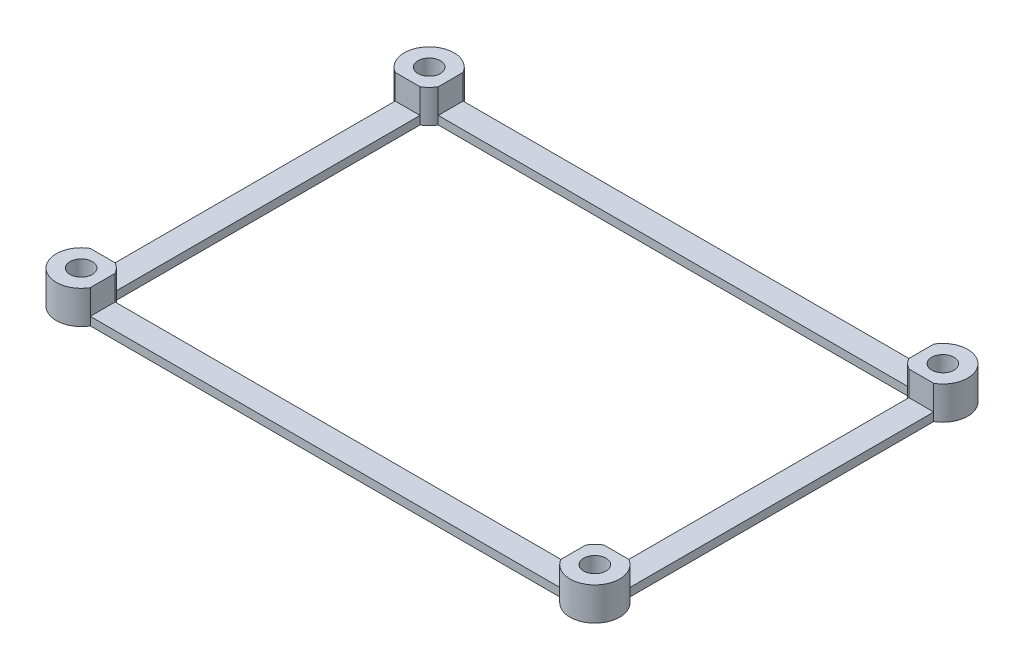
ISO-10303-21;
HEADER;
FILE_DESCRIPTION(('STEP AP214'),'2;1');
FILE_NAME('part.step','',(''),(''),'','','');
FILE_SCHEMA(('AUTOMOTIVE_DESIGN { 1 0 10303 214 1 1 1 1 }'));
ENDSEC;
DATA;
#1=APPLICATION_CONTEXT('core data for automotive mechanical design processes');
#2=APPLICATION_PROTOCOL_DEFINITION('international standard','automotive_design',2000,#1);
#3=PRODUCT_CONTEXT('',#1,'mechanical');
#4=PRODUCT('Part','Part','',(#3));
#5=PRODUCT_RELATED_PRODUCT_CATEGORY('part','',(#4));
#6=PRODUCT_DEFINITION_FORMATION('','',#4);
#7=PRODUCT_DEFINITION_CONTEXT('part definition',#1,'design');
#8=PRODUCT_DEFINITION('design','',#6,#7);
#9=PRODUCT_DEFINITION_SHAPE('','',#8);
#10=(LENGTH_UNIT() NAMED_UNIT(*) SI_UNIT(.MILLI.,.METRE.));
#11=(NAMED_UNIT(*) PLANE_ANGLE_UNIT() SI_UNIT($,.RADIAN.));
#12=(NAMED_UNIT(*) SI_UNIT($,.STERADIAN.) SOLID_ANGLE_UNIT());
#13=UNCERTAINTY_MEASURE_WITH_UNIT(LENGTH_MEASURE(1.E-05),#10,'distance_accuracy_value','');
#14=(GEOMETRIC_REPRESENTATION_CONTEXT(3) GLOBAL_UNCERTAINTY_ASSIGNED_CONTEXT((#13)) GLOBAL_UNIT_ASSIGNED_CONTEXT((#10,
#11,#12)) REPRESENTATION_CONTEXT('',''));
#15=CARTESIAN_POINT('',(0.,0.,0.));
#16=DIRECTION('',(0.,0.,1.));
#17=DIRECTION('',(1.,0.,0.));
#18=AXIS2_PLACEMENT_3D('',#15,#16,#17);
#19=CARTESIAN_POINT('',(31.,4.,-21.));
#20=DIRECTION('',(0.,1.,0.));
#21=DIRECTION('',(0.,0.,1.));
#22=AXIS2_PLACEMENT_3D('',#19,#20,#21);
#23=PLANE('',#22);
#24=DIRECTION('',(-1.,0.,0.));
#25=VECTOR('',#24,1.);
#26=CARTESIAN_POINT('',(-32.5,4.,-18.4019237886467));
#27=LINE('',#26,#25);
#28=CARTESIAN_POINT('',(-29.5,4.,-18.4019237886467));
#29=VERTEX_POINT('',#28);
#30=CARTESIAN_POINT('',(-32.5,4.,-18.4019237886467));
#31=VERTEX_POINT('',#30);
#32=EDGE_CURVE('E220',#29,#31,#27,.T.);
#33=ORIENTED_EDGE('',*,*,#32,.F.);
#34=CARTESIAN_POINT('',(-31.,4.,-21.));
#35=DIRECTION('',(0.,-1.,0.));
#36=DIRECTION('',(0.,0.,1.));
#37=AXIS2_PLACEMENT_3D('',#34,#35,#36);
#38=CIRCLE('',#37,3.);
#39=CARTESIAN_POINT('',(-28.4019237886467,4.,-19.5));
#40=VERTEX_POINT('',#39);
#41=EDGE_CURVE('E319',#40,#29,#38,.T.);
#42=ORIENTED_EDGE('',*,*,#41,.F.);
#43=DIRECTION('',(0.,0.,1.));
#44=VECTOR('',#43,1.);
#45=CARTESIAN_POINT('',(-28.4019237886467,4.,-19.5));
#46=LINE('',#45,#44);
#47=CARTESIAN_POINT('',(-28.4019237886467,4.,-22.5));
#48=VERTEX_POINT('',#47);
#49=EDGE_CURVE('E318',#48,#40,#46,.T.);
#50=ORIENTED_EDGE('',*,*,#49,.F.);
#51=CARTESIAN_POINT('',(-31.,4.,-21.));
#52=DIRECTION('',(0.,1.,0.));
#53=DIRECTION('',(0.,0.,1.));
#54=AXIS2_PLACEMENT_3D('',#51,#52,#53);
#55=CIRCLE('',#54,3.);
#56=EDGE_CURVE('E229',#48,#31,#55,.T.);
#57=ORIENTED_EDGE('',*,*,#56,.T.);
#58=EDGE_LOOP('',(#33,#42,#50,#57));
#59=FACE_BOUND('',#58,.T.);
#60=CARTESIAN_POINT('',(-31.,4.,-21.));
#61=DIRECTION('',(0.,1.,0.));
#62=DIRECTION('',(0.,0.,1.));
#63=AXIS2_PLACEMENT_3D('',#60,#61,#62);
#64=CIRCLE('',#63,1.35);
#65=CARTESIAN_POINT('',(-31.,4.,-19.65));
#66=VERTEX_POINT('',#65);
#67=EDGE_CURVE('E391',#66,#66,#64,.T.);
#68=ORIENTED_EDGE('',*,*,#67,.F.);
#69=EDGE_LOOP('',(#68));
#70=FACE_BOUND('',#69,.T.);
#71=ADVANCED_FACE('F35',(#59,#70),#23,.T.);
#72=DIRECTION('',(1.,0.,0.));
#73=VECTOR('',#72,1.);
#74=CARTESIAN_POINT('',(-32.5,4.,18.4019237886467));
#75=LINE('',#74,#73);
#76=CARTESIAN_POINT('',(-32.5,4.,18.4019237886467));
#77=VERTEX_POINT('',#76);
#78=CARTESIAN_POINT('',(-29.5,4.,18.4019237886467));
#79=VERTEX_POINT('',#78);
#80=EDGE_CURVE('E200',#77,#79,#75,.T.);
#81=ORIENTED_EDGE('',*,*,#80,.F.);
#82=CARTESIAN_POINT('',(-31.,4.,21.));
#83=DIRECTION('',(0.,1.,0.));
#84=DIRECTION('',(0.,0.,1.));
#85=AXIS2_PLACEMENT_3D('',#82,#83,#84);
#86=CIRCLE('',#85,3.);
#87=CARTESIAN_POINT('',(-28.4019237886467,4.,22.5));
#88=VERTEX_POINT('',#87);
#89=EDGE_CURVE('E216',#77,#88,#86,.T.);
#90=ORIENTED_EDGE('',*,*,#89,.T.);
#91=DIRECTION('',(0.,0.,1.));
#92=VECTOR('',#91,1.);
#93=CARTESIAN_POINT('',(-28.4019237886467,4.,19.5));
#94=LINE('',#93,#92);
#95=CARTESIAN_POINT('',(-28.4019237886467,4.,19.5));
#96=VERTEX_POINT('',#95);
#97=EDGE_CURVE('E434',#96,#88,#94,.T.);
#98=ORIENTED_EDGE('',*,*,#97,.F.);
#99=CARTESIAN_POINT('',(-31.,4.,21.));
#100=DIRECTION('',(0.,-1.,0.));
#101=DIRECTION('',(0.,0.,1.));
#102=AXIS2_PLACEMENT_3D('',#99,#100,#101);
#103=CIRCLE('',#102,3.);
#104=EDGE_CURVE('E219',#79,#96,#103,.T.);
#105=ORIENTED_EDGE('',*,*,#104,.F.);
#106=EDGE_LOOP('',(#81,#90,#98,#105));
#107=FACE_BOUND('',#106,.T.);
#108=CARTESIAN_POINT('',(-31.,4.,21.));
#109=DIRECTION('',(0.,1.,0.));
#110=DIRECTION('',(0.,0.,1.));
#111=AXIS2_PLACEMENT_3D('',#108,#109,#110);
#112=CIRCLE('',#111,1.35);
#113=CARTESIAN_POINT('',(-31.,4.,22.35));
#114=VERTEX_POINT('',#113);
#115=EDGE_CURVE('E397',#114,#114,#112,.T.);
#116=ORIENTED_EDGE('',*,*,#115,.F.);
#117=EDGE_LOOP('',(#116));
#118=FACE_BOUND('',#117,.T.);
#119=ADVANCED_FACE('F213',(#107,#118),#23,.T.);
#120=DIRECTION('',(-1.,0.,0.));
#121=VECTOR('',#120,1.);
#122=CARTESIAN_POINT('',(29.5,4.,-18.4019237886467));
#123=LINE('',#122,#121);
#124=CARTESIAN_POINT('',(32.5,4.,-18.4019237886467));
#125=VERTEX_POINT('',#124);
#126=CARTESIAN_POINT('',(29.5,4.,-18.4019237886467));
#127=VERTEX_POINT('',#126);
#128=EDGE_CURVE('E421',#125,#127,#123,.T.);
#129=ORIENTED_EDGE('',*,*,#128,.F.);
#130=CARTESIAN_POINT('',(31.,4.,-21.));
#131=DIRECTION('',(0.,1.,0.));
#132=DIRECTION('',(0.,0.,1.));
#133=AXIS2_PLACEMENT_3D('',#130,#131,#132);
#134=CIRCLE('',#133,3.);
#135=CARTESIAN_POINT('',(28.4019237886467,4.,-22.5));
#136=VERTEX_POINT('',#135);
#137=EDGE_CURVE('E235',#125,#136,#134,.T.);
#138=ORIENTED_EDGE('',*,*,#137,.T.);
#139=DIRECTION('',(0.,0.,-1.));
#140=VECTOR('',#139,1.);
#141=CARTESIAN_POINT('',(28.4019237886467,4.,-19.5));
#142=LINE('',#141,#140);
#143=CARTESIAN_POINT('',(28.4019237886467,4.,-19.5));
#144=VERTEX_POINT('',#143);
#145=EDGE_CURVE('E321',#144,#136,#142,.T.);
#146=ORIENTED_EDGE('',*,*,#145,.F.);
#147=CARTESIAN_POINT('',(31.,4.,-21.));
#148=DIRECTION('',(0.,-1.,0.));
#149=DIRECTION('',(0.,0.,1.));
#150=AXIS2_PLACEMENT_3D('',#147,#148,#149);
#151=CIRCLE('',#150,3.);
#152=EDGE_CURVE('E338',#127,#144,#151,.T.);
#153=ORIENTED_EDGE('',*,*,#152,.F.);
#154=EDGE_LOOP('',(#129,#138,#146,#153));
#155=FACE_BOUND('',#154,.T.);
#156=CARTESIAN_POINT('',(31.,4.,-21.));
#157=DIRECTION('',(0.,1.,0.));
#158=DIRECTION('',(0.,0.,1.));
#159=AXIS2_PLACEMENT_3D('',#156,#157,#158);
#160=CIRCLE('',#159,1.35);
#161=CARTESIAN_POINT('',(31.,4.,-19.65));
#162=VERTEX_POINT('',#161);
#163=EDGE_CURVE('E243',#162,#162,#160,.T.);
#164=ORIENTED_EDGE('',*,*,#163,.F.);
#165=EDGE_LOOP('',(#164));
#166=FACE_BOUND('',#165,.T.);
#167=ADVANCED_FACE('F418',(#155,#166),#23,.T.);
#168=CARTESIAN_POINT('',(-28.4019237886467,4.,-22.5));
#169=DIRECTION('',(0.,0.,1.));
#170=DIRECTION('',(1.,0.,0.));
#171=AXIS2_PLACEMENT_3D('',#168,#169,#170);
#172=PLANE('',#171);
#173=DIRECTION('',(1.,0.,0.));
#174=VECTOR('',#173,1.);
#175=CARTESIAN_POINT('',(28.4019237886467,1.,-22.5));
#176=LINE('',#175,#174);
#177=CARTESIAN_POINT('',(-28.4019237886467,0.999999999999987,-22.5));
#178=VERTEX_POINT('',#177);
#179=CARTESIAN_POINT('',(28.4019237886467,1.,-22.5));
#180=VERTEX_POINT('',#179);
#181=EDGE_CURVE('E328',#178,#180,#176,.T.);
#182=ORIENTED_EDGE('',*,*,#181,.T.);
#183=DIRECTION('',(0.,-1.,0.));
#184=VECTOR('',#183,1.);
#185=CARTESIAN_POINT('',(28.4019237886467,4.,-22.5));
#186=LINE('',#185,#184);
#187=CARTESIAN_POINT('',(28.4019237886467,0.,-22.5));
#188=VERTEX_POINT('',#187);
#189=EDGE_CURVE('E43',#180,#188,#186,.T.);
#190=ORIENTED_EDGE('',*,*,#189,.T.);
#191=DIRECTION('',(-1.,0.,0.));
#192=VECTOR('',#191,1.);
#193=CARTESIAN_POINT('',(-28.4019237886467,0.,-22.5));
#194=LINE('',#193,#192);
#195=CARTESIAN_POINT('',(-28.4019237886467,0.,-22.5));
#196=VERTEX_POINT('',#195);
#197=EDGE_CURVE('E242',#188,#196,#194,.T.);
#198=ORIENTED_EDGE('',*,*,#197,.T.);
#199=DIRECTION('',(0.,-1.,0.));
#200=VECTOR('',#199,1.);
#201=CARTESIAN_POINT('',(-28.4019237886467,4.,-22.5));
#202=LINE('',#201,#200);
#203=EDGE_CURVE('E277',#178,#196,#202,.T.);
#204=ORIENTED_EDGE('',*,*,#203,.F.);
#205=EDGE_LOOP('',(#182,#190,#198,#204));
#206=FACE_BOUND('',#205,.T.);
#207=ADVANCED_FACE('F290',(#206),#172,.F.);
#208=CARTESIAN_POINT('',(-32.5,4.,18.4019237886467));
#209=DIRECTION('',(1.,0.,0.));
#210=DIRECTION('',(0.,0.,-1.));
#211=AXIS2_PLACEMENT_3D('',#208,#209,#210);
#212=PLANE('',#211);
#213=DIRECTION('',(0.,0.,-1.));
#214=VECTOR('',#213,1.);
#215=CARTESIAN_POINT('',(-32.5,1.,-18.4019237886467));
#216=LINE('',#215,#214);
#217=CARTESIAN_POINT('',(-32.5,1.,18.4019237886467));
#218=VERTEX_POINT('',#217);
#219=CARTESIAN_POINT('',(-32.5,1.,-18.4019237886467));
#220=VERTEX_POINT('',#219);
#221=EDGE_CURVE('E302',#218,#220,#216,.T.);
#222=ORIENTED_EDGE('',*,*,#221,.T.);
#223=DIRECTION('',(0.,-1.,0.));
#224=VECTOR('',#223,1.);
#225=CARTESIAN_POINT('',(-32.5,4.,-18.4019237886467));
#226=LINE('',#225,#224);
#227=CARTESIAN_POINT('',(-32.5,0.,-18.4019237886467));
#228=VERTEX_POINT('',#227);
#229=EDGE_CURVE('E207',#220,#228,#226,.T.);
#230=ORIENTED_EDGE('',*,*,#229,.T.);
#231=DIRECTION('',(0.,0.,1.));
#232=VECTOR('',#231,1.);
#233=CARTESIAN_POINT('',(-32.5,0.,18.4019237886467));
#234=LINE('',#233,#232);
#235=CARTESIAN_POINT('',(-32.5,0.,18.4019237886467));
#236=VERTEX_POINT('',#235);
#237=EDGE_CURVE('E249',#228,#236,#234,.T.);
#238=ORIENTED_EDGE('',*,*,#237,.T.);
#239=DIRECTION('',(0.,-1.,0.));
#240=VECTOR('',#239,1.);
#241=CARTESIAN_POINT('',(-32.5,4.,18.4019237886467));
#242=LINE('',#241,#240);
#243=EDGE_CURVE('E208',#218,#236,#242,.T.);
#244=ORIENTED_EDGE('',*,*,#243,.F.);
#245=EDGE_LOOP('',(#222,#230,#238,#244));
#246=FACE_BOUND('',#245,.T.);
#247=ADVANCED_FACE('F301',(#246),#212,.F.);
#248=CARTESIAN_POINT('',(-28.4019237886467,4.,22.5));
#249=DIRECTION('',(0.,0.,-1.));
#250=DIRECTION('',(-1.,0.,0.));
#251=AXIS2_PLACEMENT_3D('',#248,#249,#250);
#252=PLANE('',#251);
#253=DIRECTION('',(-1.,0.,0.));
#254=VECTOR('',#253,1.);
#255=CARTESIAN_POINT('',(-28.4019237886467,1.,22.5));
#256=LINE('',#255,#254);
#257=CARTESIAN_POINT('',(28.4019237886467,0.999999999999987,22.5));
#258=VERTEX_POINT('',#257);
#259=CARTESIAN_POINT('',(-28.4019237886467,1.,22.5));
#260=VERTEX_POINT('',#259);
#261=EDGE_CURVE('E221',#258,#260,#256,.T.);
#262=ORIENTED_EDGE('',*,*,#261,.T.);
#263=DIRECTION('',(0.,-1.,0.));
#264=VECTOR('',#263,1.);
#265=CARTESIAN_POINT('',(-28.4019237886467,4.,22.5));
#266=LINE('',#265,#264);
#267=CARTESIAN_POINT('',(-28.4019237886467,0.,22.5));
#268=VERTEX_POINT('',#267);
#269=EDGE_CURVE('E273',#260,#268,#266,.T.);
#270=ORIENTED_EDGE('',*,*,#269,.T.);
#271=DIRECTION('',(1.,0.,0.));
#272=VECTOR('',#271,1.);
#273=CARTESIAN_POINT('',(-28.4019237886467,0.,22.5));
#274=LINE('',#273,#272);
#275=CARTESIAN_POINT('',(28.4019237886467,0.,22.5));
#276=VERTEX_POINT('',#275);
#277=EDGE_CURVE('E254',#268,#276,#274,.T.);
#278=ORIENTED_EDGE('',*,*,#277,.T.);
#279=DIRECTION('',(0.,-1.,0.));
#280=VECTOR('',#279,1.);
#281=CARTESIAN_POINT('',(28.4019237886467,4.,22.5));
#282=LINE('',#281,#280);
#283=EDGE_CURVE('E269',#258,#276,#282,.T.);
#284=ORIENTED_EDGE('',*,*,#283,.F.);
#285=EDGE_LOOP('',(#262,#270,#278,#284));
#286=FACE_BOUND('',#285,.T.);
#287=ADVANCED_FACE('F514',(#286),#252,.F.);
#288=CARTESIAN_POINT('',(32.5,4.,18.4019237886467));
#289=DIRECTION('',(-1.,0.,0.));
#290=DIRECTION('',(0.,0.,1.));
#291=AXIS2_PLACEMENT_3D('',#288,#289,#290);
#292=PLANE('',#291);
#293=DIRECTION('',(0.,0.,1.));
#294=VECTOR('',#293,1.);
#295=CARTESIAN_POINT('',(32.5,1.,18.4019237886467));
#296=LINE('',#295,#294);
#297=CARTESIAN_POINT('',(32.5,1.,-18.4019237886467));
#298=VERTEX_POINT('',#297);
#299=CARTESIAN_POINT('',(32.5,0.999999999999987,18.4019237886467));
#300=VERTEX_POINT('',#299);
#301=EDGE_CURVE('E437',#298,#300,#296,.T.);
#302=ORIENTED_EDGE('',*,*,#301,.T.);
#303=DIRECTION('',(0.,-1.,0.));
#304=VECTOR('',#303,1.);
#305=CARTESIAN_POINT('',(32.5,4.,18.4019237886467));
#306=LINE('',#305,#304);
#307=CARTESIAN_POINT('',(32.5,0.,18.4019237886467));
#308=VERTEX_POINT('',#307);
#309=EDGE_CURVE('E266',#300,#308,#306,.T.);
#310=ORIENTED_EDGE('',*,*,#309,.T.);
#311=DIRECTION('',(0.,0.,-1.));
#312=VECTOR('',#311,1.);
#313=CARTESIAN_POINT('',(32.5,0.,18.4019237886467));
#314=LINE('',#313,#312);
#315=CARTESIAN_POINT('',(32.5,0.,-18.4019237886467));
#316=VERTEX_POINT('',#315);
#317=EDGE_CURVE('E260',#308,#316,#314,.T.);
#318=ORIENTED_EDGE('',*,*,#317,.T.);
#319=DIRECTION('',(0.,-1.,0.));
#320=VECTOR('',#319,1.);
#321=CARTESIAN_POINT('',(32.5,4.,-18.4019237886467));
#322=LINE('',#321,#320);
#323=EDGE_CURVE('E232',#298,#316,#322,.T.);
#324=ORIENTED_EDGE('',*,*,#323,.F.);
#325=EDGE_LOOP('',(#302,#310,#318,#324));
#326=FACE_BOUND('',#325,.T.);
#327=ADVANCED_FACE('F524',(#326),#292,.F.);
#328=CARTESIAN_POINT('',(-29.5,4.,18.4019237886467));
#329=DIRECTION('',(1.,0.,0.));
#330=DIRECTION('',(0.,0.,-1.));
#331=AXIS2_PLACEMENT_3D('',#328,#329,#330);
#332=PLANE('',#331);
#333=DIRECTION('',(0.,-1.,0.));
#334=VECTOR('',#333,1.);
#335=CARTESIAN_POINT('',(-29.5,4.,-18.4019237886467));
#336=LINE('',#335,#334);
#337=CARTESIAN_POINT('',(-29.5,1.,-18.4019237886467));
#338=VERTEX_POINT('',#337);
#339=CARTESIAN_POINT('',(-29.5,0.,-18.4019237886467));
#340=VERTEX_POINT('',#339);
#341=EDGE_CURVE('E388',#338,#340,#336,.T.);
#342=ORIENTED_EDGE('',*,*,#341,.F.);
#343=DIRECTION('',(0.,0.,1.));
#344=VECTOR('',#343,1.);
#345=CARTESIAN_POINT('',(-29.5,1.,-18.4019237886467));
#346=LINE('',#345,#344);
#347=CARTESIAN_POINT('',(-29.5,0.999999999999987,18.4019237886467));
#348=VERTEX_POINT('',#347);
#349=EDGE_CURVE('E314',#338,#348,#346,.T.);
#350=ORIENTED_EDGE('',*,*,#349,.T.);
#351=DIRECTION('',(0.,-1.,0.));
#352=VECTOR('',#351,1.);
#353=CARTESIAN_POINT('',(-29.5,4.,18.4019237886467));
#354=LINE('',#353,#352);
#355=CARTESIAN_POINT('',(-29.5,0.,18.4019237886467));
#356=VERTEX_POINT('',#355);
#357=EDGE_CURVE('E385',#348,#356,#354,.T.);
#358=ORIENTED_EDGE('',*,*,#357,.T.);
#359=DIRECTION('',(0.,0.,1.));
#360=VECTOR('',#359,1.);
#361=CARTESIAN_POINT('',(-29.5,0.,18.4019237886467));
#362=LINE('',#361,#360);
#363=EDGE_CURVE('E344',#340,#356,#362,.T.);
#364=ORIENTED_EDGE('',*,*,#363,.F.);
#365=EDGE_LOOP('',(#342,#350,#358,#364));
#366=FACE_BOUND('',#365,.T.);
#367=ADVANCED_FACE('F464',(#366),#332,.T.);
#368=CARTESIAN_POINT('',(-28.4019237886467,4.,19.5));
#369=DIRECTION('',(0.,0.,-1.));
#370=DIRECTION('',(-1.,0.,0.));
#371=AXIS2_PLACEMENT_3D('',#368,#369,#370);
#372=PLANE('',#371);
#373=DIRECTION('',(0.,-1.,0.));
#374=VECTOR('',#373,1.);
#375=CARTESIAN_POINT('',(-28.4019237886467,4.,19.5));
#376=LINE('',#375,#374);
#377=CARTESIAN_POINT('',(-28.4019237886467,1.,19.5));
#378=VERTEX_POINT('',#377);
#379=CARTESIAN_POINT('',(-28.4019237886467,0.,19.5));
#380=VERTEX_POINT('',#379);
#381=EDGE_CURVE('E381',#378,#380,#376,.T.);
#382=ORIENTED_EDGE('',*,*,#381,.F.);
#383=DIRECTION('',(1.,0.,0.));
#384=VECTOR('',#383,1.);
#385=CARTESIAN_POINT('',(-28.4019237886467,1.,19.5));
#386=LINE('',#385,#384);
#387=CARTESIAN_POINT('',(28.4019237886467,1.,19.5));
#388=VERTEX_POINT('',#387);
#389=EDGE_CURVE('E453',#378,#388,#386,.T.);
#390=ORIENTED_EDGE('',*,*,#389,.T.);
#391=DIRECTION('',(0.,-1.,0.));
#392=VECTOR('',#391,1.);
#393=CARTESIAN_POINT('',(28.4019237886467,4.,19.5));
#394=LINE('',#393,#392);
#395=CARTESIAN_POINT('',(28.4019237886467,0.,19.5));
#396=VERTEX_POINT('',#395);
#397=EDGE_CURVE('E377',#388,#396,#394,.T.);
#398=ORIENTED_EDGE('',*,*,#397,.T.);
#399=DIRECTION('',(1.,0.,0.));
#400=VECTOR('',#399,1.);
#401=CARTESIAN_POINT('',(-28.4019237886467,0.,19.5));
#402=LINE('',#401,#400);
#403=EDGE_CURVE('E350',#380,#396,#402,.T.);
#404=ORIENTED_EDGE('',*,*,#403,.F.);
#405=EDGE_LOOP('',(#382,#390,#398,#404));
#406=FACE_BOUND('',#405,.T.);
#407=ADVANCED_FACE('F535',(#406),#372,.T.);
#408=CARTESIAN_POINT('',(29.5,4.,18.4019237886467));
#409=DIRECTION('',(-1.,0.,0.));
#410=DIRECTION('',(0.,0.,1.));
#411=AXIS2_PLACEMENT_3D('',#408,#409,#410);
#412=PLANE('',#411);
#413=DIRECTION('',(0.,-1.,0.));
#414=VECTOR('',#413,1.);
#415=CARTESIAN_POINT('',(29.5,4.,18.4019237886467));
#416=LINE('',#415,#414);
#417=CARTESIAN_POINT('',(29.5,1.,18.4019237886467));
#418=VERTEX_POINT('',#417);
#419=CARTESIAN_POINT('',(29.5,0.,18.4019237886467));
#420=VERTEX_POINT('',#419);
#421=EDGE_CURVE('E373',#418,#420,#416,.T.);
#422=ORIENTED_EDGE('',*,*,#421,.F.);
#423=DIRECTION('',(0.,0.,-1.));
#424=VECTOR('',#423,1.);
#425=CARTESIAN_POINT('',(29.5,1.,18.4019237886467));
#426=LINE('',#425,#424);
#427=CARTESIAN_POINT('',(29.5,1.,-18.4019237886467));
#428=VERTEX_POINT('',#427);
#429=EDGE_CURVE('E435',#418,#428,#426,.T.);
#430=ORIENTED_EDGE('',*,*,#429,.T.);
#431=DIRECTION('',(0.,-1.,0.));
#432=VECTOR('',#431,1.);
#433=CARTESIAN_POINT('',(29.5,4.,-18.4019237886467));
#434=LINE('',#433,#432);
#435=CARTESIAN_POINT('',(29.5,0.,-18.4019237886467));
#436=VERTEX_POINT('',#435);
#437=EDGE_CURVE('E369',#428,#436,#434,.T.);
#438=ORIENTED_EDGE('',*,*,#437,.T.);
#439=DIRECTION('',(0.,0.,-1.));
#440=VECTOR('',#439,1.);
#441=CARTESIAN_POINT('',(29.5,0.,18.4019237886467));
#442=LINE('',#441,#440);
#443=EDGE_CURVE('E356',#420,#436,#442,.T.);
#444=ORIENTED_EDGE('',*,*,#443,.F.);
#445=EDGE_LOOP('',(#422,#430,#438,#444));
#446=FACE_BOUND('',#445,.T.);
#447=ADVANCED_FACE('F503',(#446),#412,.T.);
#448=CARTESIAN_POINT('',(-28.4019237886467,4.,-19.5));
#449=DIRECTION('',(0.,0.,1.));
#450=DIRECTION('',(1.,0.,0.));
#451=AXIS2_PLACEMENT_3D('',#448,#449,#450);
#452=PLANE('',#451);
#453=DIRECTION('',(0.,-1.,0.));
#454=VECTOR('',#453,1.);
#455=CARTESIAN_POINT('',(28.4019237886467,4.,-19.5));
#456=LINE('',#455,#454);
#457=CARTESIAN_POINT('',(28.4019237886467,1.,-19.5));
#458=VERTEX_POINT('',#457);
#459=CARTESIAN_POINT('',(28.4019237886467,0.,-19.5));
#460=VERTEX_POINT('',#459);
#461=EDGE_CURVE('E365',#458,#460,#456,.T.);
#462=ORIENTED_EDGE('',*,*,#461,.F.);
#463=DIRECTION('',(-1.,0.,0.));
#464=VECTOR('',#463,1.);
#465=CARTESIAN_POINT('',(28.4019237886467,1.,-19.5));
#466=LINE('',#465,#464);
#467=CARTESIAN_POINT('',(-28.4019237886467,1.,-19.5));
#468=VERTEX_POINT('',#467);
#469=EDGE_CURVE('E323',#458,#468,#466,.T.);
#470=ORIENTED_EDGE('',*,*,#469,.T.);
#471=DIRECTION('',(0.,-1.,0.));
#472=VECTOR('',#471,1.);
#473=CARTESIAN_POINT('',(-28.4019237886467,4.,-19.5));
#474=LINE('',#473,#472);
#475=CARTESIAN_POINT('',(-28.4019237886467,0.,-19.5));
#476=VERTEX_POINT('',#475);
#477=EDGE_CURVE('E58',#468,#476,#474,.T.);
#478=ORIENTED_EDGE('',*,*,#477,.T.);
#479=DIRECTION('',(-1.,0.,0.));
#480=VECTOR('',#479,1.);
#481=CARTESIAN_POINT('',(-28.4019237886467,0.,-19.5));
#482=LINE('',#481,#480);
#483=EDGE_CURVE('E333',#460,#476,#482,.T.);
#484=ORIENTED_EDGE('',*,*,#483,.F.);
#485=EDGE_LOOP('',(#462,#470,#478,#484));
#486=FACE_BOUND('',#485,.T.);
#487=ADVANCED_FACE('F496',(#486),#452,.T.);
#488=DIRECTION('',(0.,0.,-1.));
#489=VECTOR('',#488,1.);
#490=CARTESIAN_POINT('',(28.4019237886467,4.,19.5));
#491=LINE('',#490,#489);
#492=CARTESIAN_POINT('',(28.4019237886467,4.,22.5));
#493=VERTEX_POINT('',#492);
#494=CARTESIAN_POINT('',(28.4019237886467,4.,19.5));
#495=VERTEX_POINT('',#494);
#496=EDGE_CURVE('E448',#493,#495,#491,.T.);
#497=ORIENTED_EDGE('',*,*,#496,.F.);
#498=CARTESIAN_POINT('',(31.,4.,21.));
#499=DIRECTION('',(0.,1.,0.));
#500=DIRECTION('',(0.,0.,1.));
#501=AXIS2_PLACEMENT_3D('',#498,#499,#500);
#502=CIRCLE('',#501,3.);
#503=CARTESIAN_POINT('',(32.5,4.,18.4019237886467));
#504=VERTEX_POINT('',#503);
#505=EDGE_CURVE('E228',#493,#504,#502,.T.);
#506=ORIENTED_EDGE('',*,*,#505,.T.);
#507=DIRECTION('',(1.,0.,0.));
#508=VECTOR('',#507,1.);
#509=CARTESIAN_POINT('',(29.5,4.,18.4019237886467));
#510=LINE('',#509,#508);
#511=CARTESIAN_POINT('',(29.5,4.,18.4019237886467));
#512=VERTEX_POINT('',#511);
#513=EDGE_CURVE('E330',#512,#504,#510,.T.);
#514=ORIENTED_EDGE('',*,*,#513,.F.);
#515=CARTESIAN_POINT('',(31.,4.,21.));
#516=DIRECTION('',(0.,-1.,0.));
#517=DIRECTION('',(0.,0.,1.));
#518=AXIS2_PLACEMENT_3D('',#515,#516,#517);
#519=CIRCLE('',#518,3.);
#520=EDGE_CURVE('E335',#495,#512,#519,.T.);
#521=ORIENTED_EDGE('',*,*,#520,.F.);
#522=EDGE_LOOP('',(#497,#506,#514,#521));
#523=FACE_BOUND('',#522,.T.);
#524=CARTESIAN_POINT('',(31.,4.,21.));
#525=DIRECTION('',(0.,1.,0.));
#526=DIRECTION('',(0.,0.,1.));
#527=AXIS2_PLACEMENT_3D('',#524,#525,#526);
#528=CIRCLE('',#527,1.35);
#529=CARTESIAN_POINT('',(31.,4.,22.35));
#530=VERTEX_POINT('',#529);
#531=EDGE_CURVE('E403',#530,#530,#528,.T.);
#532=ORIENTED_EDGE('',*,*,#531,.F.);
#533=EDGE_LOOP('',(#532));
#534=FACE_BOUND('',#533,.T.);
#535=ADVANCED_FACE('F489',(#523,#534),#23,.T.);
#536=CARTESIAN_POINT('',(31.,0.,-21.));
#537=DIRECTION('',(0.,1.,0.));
#538=DIRECTION('',(0.,0.,1.));
#539=AXIS2_PLACEMENT_3D('',#536,#537,#538);
#540=PLANE('',#539);
#541=CARTESIAN_POINT('',(-31.,0.,-21.));
#542=DIRECTION('',(0.,1.,0.));
#543=DIRECTION('',(0.,0.,1.));
#544=AXIS2_PLACEMENT_3D('',#541,#542,#543);
#545=CIRCLE('',#544,1.35);
#546=CARTESIAN_POINT('',(-31.,0.,-19.65));
#547=VERTEX_POINT('',#546);
#548=EDGE_CURVE('E390',#547,#547,#545,.T.);
#549=ORIENTED_EDGE('',*,*,#548,.T.);
#550=EDGE_LOOP('',(#549));
#551=FACE_BOUND('',#550,.T.);
#552=CARTESIAN_POINT('',(-31.,0.,21.));
#553=DIRECTION('',(0.,1.,0.));
#554=DIRECTION('',(0.,0.,1.));
#555=AXIS2_PLACEMENT_3D('',#552,#553,#554);
#556=CIRCLE('',#555,1.35);
#557=CARTESIAN_POINT('',(-31.,0.,22.35));
#558=VERTEX_POINT('',#557);
#559=EDGE_CURVE('E394',#558,#558,#556,.T.);
#560=ORIENTED_EDGE('',*,*,#559,.T.);
#561=EDGE_LOOP('',(#560));
#562=FACE_BOUND('',#561,.T.);
#563=CARTESIAN_POINT('',(31.,0.,21.));
#564=DIRECTION('',(0.,1.,0.));
#565=DIRECTION('',(0.,0.,1.));
#566=AXIS2_PLACEMENT_3D('',#563,#564,#565);
#567=CIRCLE('',#566,1.35);
#568=CARTESIAN_POINT('',(31.,0.,22.35));
#569=VERTEX_POINT('',#568);
#570=EDGE_CURVE('E400',#569,#569,#567,.T.);
#571=ORIENTED_EDGE('',*,*,#570,.T.);
#572=EDGE_LOOP('',(#571));
#573=FACE_BOUND('',#572,.T.);
#574=CARTESIAN_POINT('',(31.,0.,-21.));
#575=DIRECTION('',(0.,1.,0.));
#576=DIRECTION('',(0.,0.,1.));
#577=AXIS2_PLACEMENT_3D('',#574,#575,#576);
#578=CIRCLE('',#577,1.35);
#579=CARTESIAN_POINT('',(31.,0.,-19.65));
#580=VERTEX_POINT('',#579);
#581=EDGE_CURVE('E406',#580,#580,#578,.T.);
#582=ORIENTED_EDGE('',*,*,#581,.T.);
#583=EDGE_LOOP('',(#582));
#584=FACE_BOUND('',#583,.T.);
#585=CARTESIAN_POINT('',(31.,0.,-21.));
#586=DIRECTION('',(0.,1.,0.));
#587=DIRECTION('',(0.,0.,1.));
#588=AXIS2_PLACEMENT_3D('',#585,#586,#587);
#589=CIRCLE('',#588,3.);
#590=EDGE_CURVE('E239',#316,#188,#589,.T.);
#591=ORIENTED_EDGE('',*,*,#590,.F.);
#592=ORIENTED_EDGE('',*,*,#317,.F.);
#593=CARTESIAN_POINT('',(31.,0.,21.));
#594=DIRECTION('',(0.,1.,0.));
#595=DIRECTION('',(0.,0.,1.));
#596=AXIS2_PLACEMENT_3D('',#593,#594,#595);
#597=CIRCLE('',#596,3.);
#598=EDGE_CURVE('E257',#276,#308,#597,.T.);
#599=ORIENTED_EDGE('',*,*,#598,.F.);
#600=ORIENTED_EDGE('',*,*,#277,.F.);
#601=CARTESIAN_POINT('',(-31.,0.,21.));
#602=DIRECTION('',(0.,1.,0.));
#603=DIRECTION('',(0.,0.,1.));
#604=AXIS2_PLACEMENT_3D('',#601,#602,#603);
#605=CIRCLE('',#604,3.);
#606=EDGE_CURVE('E252',#236,#268,#605,.T.);
#607=ORIENTED_EDGE('',*,*,#606,.F.);
#608=ORIENTED_EDGE('',*,*,#237,.F.);
#609=CARTESIAN_POINT('',(-31.,0.,-21.));
#610=DIRECTION('',(0.,1.,0.));
#611=DIRECTION('',(0.,0.,1.));
#612=AXIS2_PLACEMENT_3D('',#609,#610,#611);
#613=CIRCLE('',#612,3.);
#614=EDGE_CURVE('E246',#196,#228,#613,.T.);
#615=ORIENTED_EDGE('',*,*,#614,.F.);
#616=ORIENTED_EDGE('',*,*,#197,.F.);
#617=EDGE_LOOP('',(#591,#592,#599,#600,#607,#608,#615,#616));
#618=FACE_BOUND('',#617,.T.);
#619=CARTESIAN_POINT('',(-31.,0.,-21.));
#620=DIRECTION('',(0.,-1.,0.));
#621=DIRECTION('',(0.,0.,1.));
#622=AXIS2_PLACEMENT_3D('',#619,#620,#621);
#623=CIRCLE('',#622,3.);
#624=EDGE_CURVE('E341',#476,#340,#623,.T.);
#625=ORIENTED_EDGE('',*,*,#624,.T.);
#626=ORIENTED_EDGE('',*,*,#363,.T.);
#627=CARTESIAN_POINT('',(-31.,0.,21.));
#628=DIRECTION('',(0.,-1.,0.));
#629=DIRECTION('',(0.,0.,1.));
#630=AXIS2_PLACEMENT_3D('',#627,#628,#629);
#631=CIRCLE('',#630,3.);
#632=EDGE_CURVE('E347',#356,#380,#631,.T.);
#633=ORIENTED_EDGE('',*,*,#632,.T.);
#634=ORIENTED_EDGE('',*,*,#403,.T.);
#635=CARTESIAN_POINT('',(31.,0.,21.));
#636=DIRECTION('',(0.,-1.,0.));
#637=DIRECTION('',(0.,0.,1.));
#638=AXIS2_PLACEMENT_3D('',#635,#636,#637);
#639=CIRCLE('',#638,3.);
#640=EDGE_CURVE('E353',#396,#420,#639,.T.);
#641=ORIENTED_EDGE('',*,*,#640,.T.);
#642=ORIENTED_EDGE('',*,*,#443,.T.);
#643=CARTESIAN_POINT('',(31.,0.,-21.));
#644=DIRECTION('',(0.,-1.,0.));
#645=DIRECTION('',(0.,0.,1.));
#646=AXIS2_PLACEMENT_3D('',#643,#644,#645);
#647=CIRCLE('',#646,3.);
#648=EDGE_CURVE('E359',#436,#460,#647,.T.);
#649=ORIENTED_EDGE('',*,*,#648,.T.);
#650=ORIENTED_EDGE('',*,*,#483,.T.);
#651=EDGE_LOOP('',(#625,#626,#633,#634,#641,#642,#649,#650));
#652=FACE_BOUND('',#651,.T.);
#653=ADVANCED_FACE('F294',(#551,#562,#573,#584,#618,#652),#540,.F.);
#654=CARTESIAN_POINT('',(31.,4.,-21.));
#655=DIRECTION('',(0.,-1.,0.));
#656=DIRECTION('',(0.,0.,-1.));
#657=AXIS2_PLACEMENT_3D('',#654,#655,#656);
#658=CYLINDRICAL_SURFACE('',#657,3.);
#659=ORIENTED_EDGE('',*,*,#590,.T.);
#660=ORIENTED_EDGE('',*,*,#189,.F.);
#661=EDGE_CURVE('E12',#136,#180,#186,.T.);
#662=ORIENTED_EDGE('',*,*,#661,.F.);
#663=ORIENTED_EDGE('',*,*,#137,.F.);
#664=EDGE_CURVE('E263',#125,#298,#322,.T.);
#665=ORIENTED_EDGE('',*,*,#664,.T.);
#666=ORIENTED_EDGE('',*,*,#323,.T.);
#667=EDGE_LOOP('',(#659,#660,#662,#663,#665,#666));
#668=FACE_BOUND('',#667,.T.);
#669=ADVANCED_FACE('F37',(#668),#658,.T.);
#670=CARTESIAN_POINT('',(-31.,4.,-21.));
#671=DIRECTION('',(0.,-1.,0.));
#672=DIRECTION('',(0.,0.,-1.));
#673=AXIS2_PLACEMENT_3D('',#670,#671,#672);
#674=CYLINDRICAL_SURFACE('',#673,3.);
#675=ORIENTED_EDGE('',*,*,#614,.T.);
#676=ORIENTED_EDGE('',*,*,#229,.F.);
#677=EDGE_CURVE('E275',#31,#220,#226,.T.);
#678=ORIENTED_EDGE('',*,*,#677,.F.);
#679=ORIENTED_EDGE('',*,*,#56,.F.);
#680=EDGE_CURVE('E278',#48,#178,#202,.T.);
#681=ORIENTED_EDGE('',*,*,#680,.T.);
#682=ORIENTED_EDGE('',*,*,#203,.T.);
#683=EDGE_LOOP('',(#675,#676,#678,#679,#681,#682));
#684=FACE_BOUND('',#683,.T.);
#685=ADVANCED_FACE('F283',(#684),#674,.T.);
#686=CARTESIAN_POINT('',(-31.,4.,21.));
#687=DIRECTION('',(0.,-1.,0.));
#688=DIRECTION('',(0.,0.,-1.));
#689=AXIS2_PLACEMENT_3D('',#686,#687,#688);
#690=CYLINDRICAL_SURFACE('',#689,3.);
#691=ORIENTED_EDGE('',*,*,#606,.T.);
#692=ORIENTED_EDGE('',*,*,#269,.F.);
#693=EDGE_CURVE('E227',#88,#260,#266,.T.);
#694=ORIENTED_EDGE('',*,*,#693,.F.);
#695=ORIENTED_EDGE('',*,*,#89,.F.);
#696=EDGE_CURVE('E197',#77,#218,#242,.T.);
#697=ORIENTED_EDGE('',*,*,#696,.T.);
#698=ORIENTED_EDGE('',*,*,#243,.T.);
#699=EDGE_LOOP('',(#691,#692,#694,#695,#697,#698));
#700=FACE_BOUND('',#699,.T.);
#701=ADVANCED_FACE('F224',(#700),#690,.T.);
#702=CARTESIAN_POINT('',(31.,4.,21.));
#703=DIRECTION('',(0.,-1.,0.));
#704=DIRECTION('',(0.,0.,-1.));
#705=AXIS2_PLACEMENT_3D('',#702,#703,#704);
#706=CYLINDRICAL_SURFACE('',#705,3.);
#707=ORIENTED_EDGE('',*,*,#598,.T.);
#708=ORIENTED_EDGE('',*,*,#309,.F.);
#709=EDGE_CURVE('E267',#504,#300,#306,.T.);
#710=ORIENTED_EDGE('',*,*,#709,.F.);
#711=ORIENTED_EDGE('',*,*,#505,.F.);
#712=EDGE_CURVE('E270',#493,#258,#282,.T.);
#713=ORIENTED_EDGE('',*,*,#712,.T.);
#714=ORIENTED_EDGE('',*,*,#283,.T.);
#715=EDGE_LOOP('',(#707,#708,#710,#711,#713,#714));
#716=FACE_BOUND('',#715,.T.);
#717=ADVANCED_FACE('F521',(#716),#706,.T.);
#718=CARTESIAN_POINT('',(31.,4.,-21.));
#719=DIRECTION('',(0.,-1.,0.));
#720=DIRECTION('',(0.,0.,-1.));
#721=AXIS2_PLACEMENT_3D('',#718,#719,#720);
#722=CYLINDRICAL_SURFACE('',#721,1.35);
#723=ORIENTED_EDGE('',*,*,#163,.T.);
#724=EDGE_LOOP('',(#723));
#725=FACE_BOUND('',#724,.T.);
#726=ORIENTED_EDGE('',*,*,#581,.F.);
#727=EDGE_LOOP('',(#726));
#728=FACE_BOUND('',#727,.T.);
#729=ADVANCED_FACE('F528',(#725,#728),#722,.F.);
#730=CARTESIAN_POINT('',(31.,4.,21.));
#731=DIRECTION('',(0.,-1.,0.));
#732=DIRECTION('',(0.,0.,-1.));
#733=AXIS2_PLACEMENT_3D('',#730,#731,#732);
#734=CYLINDRICAL_SURFACE('',#733,1.35);
#735=ORIENTED_EDGE('',*,*,#531,.T.);
#736=EDGE_LOOP('',(#735));
#737=FACE_BOUND('',#736,.T.);
#738=ORIENTED_EDGE('',*,*,#570,.F.);
#739=EDGE_LOOP('',(#738));
#740=FACE_BOUND('',#739,.T.);
#741=ADVANCED_FACE('F804',(#737,#740),#734,.F.);
#742=CARTESIAN_POINT('',(-31.,4.,21.));
#743=DIRECTION('',(0.,-1.,0.));
#744=DIRECTION('',(0.,0.,-1.));
#745=AXIS2_PLACEMENT_3D('',#742,#743,#744);
#746=CYLINDRICAL_SURFACE('',#745,1.35);
#747=ORIENTED_EDGE('',*,*,#115,.T.);
#748=EDGE_LOOP('',(#747));
#749=FACE_BOUND('',#748,.T.);
#750=ORIENTED_EDGE('',*,*,#559,.F.);
#751=EDGE_LOOP('',(#750));
#752=FACE_BOUND('',#751,.T.);
#753=ADVANCED_FACE('F483',(#749,#752),#746,.F.);
#754=CARTESIAN_POINT('',(-31.,4.,-21.));
#755=DIRECTION('',(0.,-1.,0.));
#756=DIRECTION('',(0.,0.,-1.));
#757=AXIS2_PLACEMENT_3D('',#754,#755,#756);
#758=CYLINDRICAL_SURFACE('',#757,1.35);
#759=ORIENTED_EDGE('',*,*,#67,.T.);
#760=EDGE_LOOP('',(#759));
#761=FACE_BOUND('',#760,.T.);
#762=ORIENTED_EDGE('',*,*,#548,.F.);
#763=EDGE_LOOP('',(#762));
#764=FACE_BOUND('',#763,.T.);
#765=ADVANCED_FACE('F475',(#761,#764),#758,.F.);
#766=CARTESIAN_POINT('',(-31.,4.,-21.));
#767=DIRECTION('',(0.,-1.,0.));
#768=DIRECTION('',(0.,0.,-1.));
#769=AXIS2_PLACEMENT_3D('',#766,#767,#768);
#770=CYLINDRICAL_SURFACE('',#769,3.);
#771=ORIENTED_EDGE('',*,*,#624,.F.);
#772=ORIENTED_EDGE('',*,*,#477,.F.);
#773=EDGE_CURVE('E50',#40,#468,#474,.T.);
#774=ORIENTED_EDGE('',*,*,#773,.F.);
#775=ORIENTED_EDGE('',*,*,#41,.T.);
#776=EDGE_CURVE('E310',#29,#338,#336,.T.);
#777=ORIENTED_EDGE('',*,*,#776,.T.);
#778=ORIENTED_EDGE('',*,*,#341,.T.);
#779=EDGE_LOOP('',(#771,#772,#774,#775,#777,#778));
#780=FACE_BOUND('',#779,.T.);
#781=ADVANCED_FACE('F473',(#780),#770,.T.);
#782=CARTESIAN_POINT('',(-31.,4.,21.));
#783=DIRECTION('',(0.,-1.,0.));
#784=DIRECTION('',(0.,0.,-1.));
#785=AXIS2_PLACEMENT_3D('',#782,#783,#784);
#786=CYLINDRICAL_SURFACE('',#785,3.);
#787=ORIENTED_EDGE('',*,*,#632,.F.);
#788=ORIENTED_EDGE('',*,*,#357,.F.);
#789=EDGE_CURVE('E386',#79,#348,#354,.T.);
#790=ORIENTED_EDGE('',*,*,#789,.F.);
#791=ORIENTED_EDGE('',*,*,#104,.T.);
#792=EDGE_CURVE('E382',#96,#378,#376,.T.);
#793=ORIENTED_EDGE('',*,*,#792,.T.);
#794=ORIENTED_EDGE('',*,*,#381,.T.);
#795=EDGE_LOOP('',(#787,#788,#790,#791,#793,#794));
#796=FACE_BOUND('',#795,.T.);
#797=ADVANCED_FACE('F469',(#796),#786,.T.);
#798=CARTESIAN_POINT('',(31.,4.,21.));
#799=DIRECTION('',(0.,-1.,0.));
#800=DIRECTION('',(0.,0.,-1.));
#801=AXIS2_PLACEMENT_3D('',#798,#799,#800);
#802=CYLINDRICAL_SURFACE('',#801,3.);
#803=ORIENTED_EDGE('',*,*,#640,.F.);
#804=ORIENTED_EDGE('',*,*,#397,.F.);
#805=EDGE_CURVE('E378',#495,#388,#394,.T.);
#806=ORIENTED_EDGE('',*,*,#805,.F.);
#807=ORIENTED_EDGE('',*,*,#520,.T.);
#808=EDGE_CURVE('E374',#512,#418,#416,.T.);
#809=ORIENTED_EDGE('',*,*,#808,.T.);
#810=ORIENTED_EDGE('',*,*,#421,.T.);
#811=EDGE_LOOP('',(#803,#804,#806,#807,#809,#810));
#812=FACE_BOUND('',#811,.T.);
#813=ADVANCED_FACE('F481',(#812),#802,.T.);
#814=CARTESIAN_POINT('',(31.,4.,-21.));
#815=DIRECTION('',(0.,-1.,0.));
#816=DIRECTION('',(0.,0.,-1.));
#817=AXIS2_PLACEMENT_3D('',#814,#815,#816);
#818=CYLINDRICAL_SURFACE('',#817,3.);
#819=ORIENTED_EDGE('',*,*,#648,.F.);
#820=ORIENTED_EDGE('',*,*,#437,.F.);
#821=EDGE_CURVE('E370',#127,#428,#434,.T.);
#822=ORIENTED_EDGE('',*,*,#821,.F.);
#823=ORIENTED_EDGE('',*,*,#152,.T.);
#824=EDGE_CURVE('E366',#144,#458,#456,.T.);
#825=ORIENTED_EDGE('',*,*,#824,.T.);
#826=ORIENTED_EDGE('',*,*,#461,.T.);
#827=EDGE_LOOP('',(#819,#820,#822,#823,#825,#826));
#828=FACE_BOUND('',#827,.T.);
#829=ADVANCED_FACE('F590',(#828),#818,.T.);
#830=CARTESIAN_POINT('',(28.4019237886467,-56.8830123989964,-19.5));
#831=DIRECTION('',(1.,0.,0.));
#832=DIRECTION('',(0.,0.,-1.));
#833=AXIS2_PLACEMENT_3D('',#830,#831,#832);
#834=PLANE('',#833);
#835=DIRECTION('',(0.,0.,1.));
#836=VECTOR('',#835,1.);
#837=CARTESIAN_POINT('',(28.4019237886467,1.,-19.5));
#838=LINE('',#837,#836);
#839=EDGE_CURVE('E331',#180,#458,#838,.T.);
#840=ORIENTED_EDGE('',*,*,#839,.T.);
#841=ORIENTED_EDGE('',*,*,#824,.F.);
#842=ORIENTED_EDGE('',*,*,#145,.T.);
#843=ORIENTED_EDGE('',*,*,#661,.T.);
#844=EDGE_LOOP('',(#840,#841,#842,#843));
#845=FACE_BOUND('',#844,.T.);
#846=ADVANCED_FACE('F424',(#845),#834,.F.);
#847=CARTESIAN_POINT('',(-28.4019237886467,-56.8830123989964,-19.5));
#848=DIRECTION('',(-1.,0.,0.));
#849=DIRECTION('',(0.,0.,1.));
#850=AXIS2_PLACEMENT_3D('',#847,#848,#849);
#851=PLANE('',#850);
#852=DIRECTION('',(0.,0.,-1.));
#853=VECTOR('',#852,1.);
#854=CARTESIAN_POINT('',(-28.4019237886467,1.,-19.5));
#855=LINE('',#854,#853);
#856=EDGE_CURVE('E320',#468,#178,#855,.T.);
#857=ORIENTED_EDGE('',*,*,#856,.T.);
#858=ORIENTED_EDGE('',*,*,#680,.F.);
#859=ORIENTED_EDGE('',*,*,#49,.T.);
#860=ORIENTED_EDGE('',*,*,#773,.T.);
#861=EDGE_LOOP('',(#857,#858,#859,#860));
#862=FACE_BOUND('',#861,.T.);
#863=ADVANCED_FACE('F586',(#862),#851,.F.);
#864=CARTESIAN_POINT('',(31.,1.,-21.));
#865=DIRECTION('',(0.,1.,0.));
#866=DIRECTION('',(0.,0.,1.));
#867=AXIS2_PLACEMENT_3D('',#864,#865,#866);
#868=PLANE('',#867);
#869=ORIENTED_EDGE('',*,*,#839,.F.);
#870=ORIENTED_EDGE('',*,*,#181,.F.);
#871=ORIENTED_EDGE('',*,*,#856,.F.);
#872=ORIENTED_EDGE('',*,*,#469,.F.);
#873=EDGE_LOOP('',(#869,#870,#871,#872));
#874=FACE_BOUND('',#873,.T.);
#875=ADVANCED_FACE('F428',(#874),#868,.T.);
#876=CARTESIAN_POINT('',(29.5,-56.8830123989964,-18.4019237886467));
#877=DIRECTION('',(0.,0.,-1.));
#878=DIRECTION('',(-1.,0.,0.));
#879=AXIS2_PLACEMENT_3D('',#876,#877,#878);
#880=PLANE('',#879);
#881=DIRECTION('',(1.,0.,0.));
#882=VECTOR('',#881,1.);
#883=CARTESIAN_POINT('',(29.5,1.,-18.4019237886467));
#884=LINE('',#883,#882);
#885=EDGE_CURVE('E441',#428,#298,#884,.T.);
#886=ORIENTED_EDGE('',*,*,#885,.T.);
#887=ORIENTED_EDGE('',*,*,#664,.F.);
#888=ORIENTED_EDGE('',*,*,#128,.T.);
#889=ORIENTED_EDGE('',*,*,#821,.T.);
#890=EDGE_LOOP('',(#886,#887,#888,#889));
#891=FACE_BOUND('',#890,.T.);
#892=ADVANCED_FACE('F547',(#891),#880,.F.);
#893=CARTESIAN_POINT('',(29.5,-56.8830123989964,18.4019237886467));
#894=DIRECTION('',(0.,0.,1.));
#895=DIRECTION('',(1.,0.,0.));
#896=AXIS2_PLACEMENT_3D('',#893,#894,#895);
#897=PLANE('',#896);
#898=DIRECTION('',(-1.,0.,0.));
#899=VECTOR('',#898,1.);
#900=CARTESIAN_POINT('',(29.5,1.,18.4019237886467));
#901=LINE('',#900,#899);
#902=EDGE_CURVE('E432',#300,#418,#901,.T.);
#903=ORIENTED_EDGE('',*,*,#902,.T.);
#904=ORIENTED_EDGE('',*,*,#808,.F.);
#905=ORIENTED_EDGE('',*,*,#513,.T.);
#906=ORIENTED_EDGE('',*,*,#709,.T.);
#907=EDGE_LOOP('',(#903,#904,#905,#906));
#908=FACE_BOUND('',#907,.T.);
#909=ADVANCED_FACE('F561',(#908),#897,.F.);
#910=CARTESIAN_POINT('',(31.,1.,-21.));
#911=DIRECTION('',(0.,1.,0.));
#912=DIRECTION('',(0.,0.,1.));
#913=AXIS2_PLACEMENT_3D('',#910,#911,#912);
#914=PLANE('',#913);
#915=ORIENTED_EDGE('',*,*,#429,.F.);
#916=ORIENTED_EDGE('',*,*,#902,.F.);
#917=ORIENTED_EDGE('',*,*,#301,.F.);
#918=ORIENTED_EDGE('',*,*,#885,.F.);
#919=EDGE_LOOP('',(#915,#916,#917,#918));
#920=FACE_BOUND('',#919,.T.);
#921=ADVANCED_FACE('F550',(#920),#914,.T.);
#922=CARTESIAN_POINT('',(-28.4019237886467,-56.8830123989964,19.5));
#923=DIRECTION('',(-1.,0.,0.));
#924=DIRECTION('',(0.,0.,1.));
#925=AXIS2_PLACEMENT_3D('',#922,#923,#924);
#926=PLANE('',#925);
#927=DIRECTION('',(0.,0.,-1.));
#928=VECTOR('',#927,1.);
#929=CARTESIAN_POINT('',(-28.4019237886467,1.,19.5));
#930=LINE('',#929,#928);
#931=EDGE_CURVE('E447',#260,#378,#930,.T.);
#932=ORIENTED_EDGE('',*,*,#931,.T.);
#933=ORIENTED_EDGE('',*,*,#792,.F.);
#934=ORIENTED_EDGE('',*,*,#97,.T.);
#935=ORIENTED_EDGE('',*,*,#693,.T.);
#936=EDGE_LOOP('',(#932,#933,#934,#935));
#937=FACE_BOUND('',#936,.T.);
#938=ADVANCED_FACE('F569',(#937),#926,.F.);
#939=CARTESIAN_POINT('',(28.4019237886467,-56.8830123989964,19.5));
#940=DIRECTION('',(1.,0.,0.));
#941=DIRECTION('',(0.,0.,-1.));
#942=AXIS2_PLACEMENT_3D('',#939,#940,#941);
#943=PLANE('',#942);
#944=DIRECTION('',(0.,0.,1.));
#945=VECTOR('',#944,1.);
#946=CARTESIAN_POINT('',(28.4019237886467,1.,19.5));
#947=LINE('',#946,#945);
#948=EDGE_CURVE('E450',#388,#258,#947,.T.);
#949=ORIENTED_EDGE('',*,*,#948,.T.);
#950=ORIENTED_EDGE('',*,*,#712,.F.);
#951=ORIENTED_EDGE('',*,*,#496,.T.);
#952=ORIENTED_EDGE('',*,*,#805,.T.);
#953=EDGE_LOOP('',(#949,#950,#951,#952));
#954=FACE_BOUND('',#953,.T.);
#955=ADVANCED_FACE('F563',(#954),#943,.F.);
#956=CARTESIAN_POINT('',(31.,1.,-21.));
#957=DIRECTION('',(0.,1.,0.));
#958=DIRECTION('',(0.,0.,1.));
#959=AXIS2_PLACEMENT_3D('',#956,#957,#958);
#960=PLANE('',#959);
#961=ORIENTED_EDGE('',*,*,#931,.F.);
#962=ORIENTED_EDGE('',*,*,#261,.F.);
#963=ORIENTED_EDGE('',*,*,#948,.F.);
#964=ORIENTED_EDGE('',*,*,#389,.F.);
#965=EDGE_LOOP('',(#961,#962,#963,#964));
#966=FACE_BOUND('',#965,.T.);
#967=ADVANCED_FACE('F567',(#966),#960,.T.);
#968=CARTESIAN_POINT('',(-32.5,-56.8830123989964,-18.4019237886467));
#969=DIRECTION('',(0.,0.,-1.));
#970=DIRECTION('',(-1.,0.,0.));
#971=AXIS2_PLACEMENT_3D('',#968,#969,#970);
#972=PLANE('',#971);
#973=DIRECTION('',(1.,0.,0.));
#974=VECTOR('',#973,1.);
#975=CARTESIAN_POINT('',(-32.5,1.,-18.4019237886467));
#976=LINE('',#975,#974);
#977=EDGE_CURVE('E306',#220,#338,#976,.T.);
#978=ORIENTED_EDGE('',*,*,#977,.T.);
#979=ORIENTED_EDGE('',*,*,#776,.F.);
#980=ORIENTED_EDGE('',*,*,#32,.T.);
#981=ORIENTED_EDGE('',*,*,#677,.T.);
#982=EDGE_LOOP('',(#978,#979,#980,#981));
#983=FACE_BOUND('',#982,.T.);
#984=ADVANCED_FACE('F305',(#983),#972,.F.);
#985=CARTESIAN_POINT('',(-32.5,-56.8830123989964,18.4019237886467));
#986=DIRECTION('',(0.,0.,1.));
#987=DIRECTION('',(1.,0.,0.));
#988=AXIS2_PLACEMENT_3D('',#985,#986,#987);
#989=PLANE('',#988);
#990=DIRECTION('',(-1.,0.,0.));
#991=VECTOR('',#990,1.);
#992=CARTESIAN_POINT('',(-32.5,1.,18.4019237886467));
#993=LINE('',#992,#991);
#994=EDGE_CURVE('E203',#348,#218,#993,.T.);
#995=ORIENTED_EDGE('',*,*,#994,.T.);
#996=ORIENTED_EDGE('',*,*,#696,.F.);
#997=ORIENTED_EDGE('',*,*,#80,.T.);
#998=ORIENTED_EDGE('',*,*,#789,.T.);
#999=EDGE_LOOP('',(#995,#996,#997,#998));
#1000=FACE_BOUND('',#999,.T.);
#1001=ADVANCED_FACE('F199',(#1000),#989,.F.);
#1002=CARTESIAN_POINT('',(31.,1.,-21.));
#1003=DIRECTION('',(0.,1.,0.));
#1004=DIRECTION('',(0.,0.,1.));
#1005=AXIS2_PLACEMENT_3D('',#1002,#1003,#1004);
#1006=PLANE('',#1005);
#1007=ORIENTED_EDGE('',*,*,#221,.F.);
#1008=ORIENTED_EDGE('',*,*,#994,.F.);
#1009=ORIENTED_EDGE('',*,*,#349,.F.);
#1010=ORIENTED_EDGE('',*,*,#977,.F.);
#1011=EDGE_LOOP('',(#1007,#1008,#1009,#1010));
#1012=FACE_BOUND('',#1011,.T.);
#1013=ADVANCED_FACE('F741',(#1012),#1006,.T.);
#1014=CLOSED_SHELL('',(#71,#119,#167,#207,#247,#287,#327,#367,#407,#447,#487,#535,#653,#669,
#685,#701,#717,#729,#741,#753,#765,#781,#797,#813,#829,#846,#863,#875,#892,#909,#921,#938,#955,
#967,#984,#1001,#1013));
#1015=MANIFOLD_SOLID_BREP('B2',#1014);
#1016=ADVANCED_BREP_SHAPE_REPRESENTATION('',(#18,#1015),#14);
#1017=SHAPE_DEFINITION_REPRESENTATION(#9,#1016);
ENDSEC;
END-ISO-10303-21;
